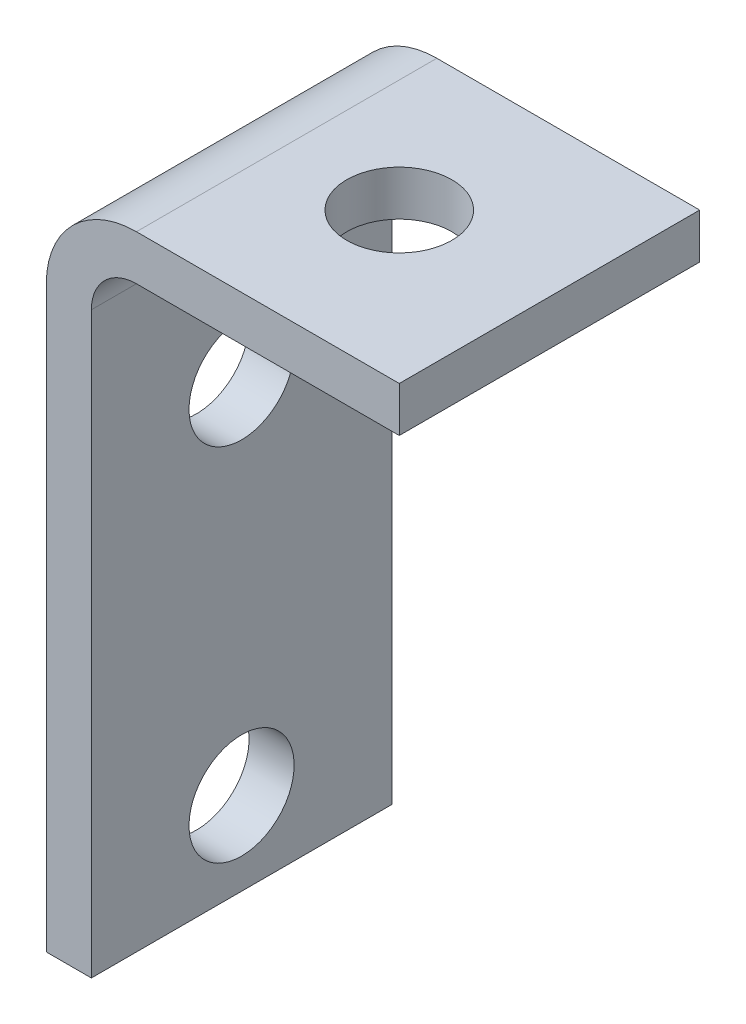
ISO-10303-21;
HEADER;
FILE_DESCRIPTION(('STEP AP214'),'2;1');
FILE_NAME('part.step','',(''),(''),'','','');
FILE_SCHEMA(('AUTOMOTIVE_DESIGN { 1 0 10303 214 1 1 1 1 }'));
ENDSEC;
DATA;
#1=APPLICATION_CONTEXT('core data for automotive mechanical design processes');
#2=APPLICATION_PROTOCOL_DEFINITION('international standard','automotive_design',2000,#1);
#3=PRODUCT_CONTEXT('',#1,'mechanical');
#4=PRODUCT('Part','Part','',(#3));
#5=PRODUCT_RELATED_PRODUCT_CATEGORY('part','',(#4));
#6=PRODUCT_DEFINITION_FORMATION('','',#4);
#7=PRODUCT_DEFINITION_CONTEXT('part definition',#1,'design');
#8=PRODUCT_DEFINITION('design','',#6,#7);
#9=PRODUCT_DEFINITION_SHAPE('','',#8);
#10=(LENGTH_UNIT() NAMED_UNIT(*) SI_UNIT(.MILLI.,.METRE.));
#11=(NAMED_UNIT(*) PLANE_ANGLE_UNIT() SI_UNIT($,.RADIAN.));
#12=(NAMED_UNIT(*) SI_UNIT($,.STERADIAN.) SOLID_ANGLE_UNIT());
#13=UNCERTAINTY_MEASURE_WITH_UNIT(LENGTH_MEASURE(1.E-05),#10,'distance_accuracy_value','');
#14=(GEOMETRIC_REPRESENTATION_CONTEXT(3) GLOBAL_UNCERTAINTY_ASSIGNED_CONTEXT((#13)) GLOBAL_UNIT_ASSIGNED_CONTEXT((#10,
#11,#12)) REPRESENTATION_CONTEXT('',''));
#15=CARTESIAN_POINT('',(0.,0.,0.));
#16=DIRECTION('',(0.,0.,1.));
#17=DIRECTION('',(1.,0.,0.));
#18=AXIS2_PLACEMENT_3D('',#15,#16,#17);
#19=CARTESIAN_POINT('',(0.,77.0555112459999,-39.9999999999999));
#20=DIRECTION('',(-1.,0.,0.));
#21=DIRECTION('',(0.,-1.,0.));
#22=AXIS2_PLACEMENT_3D('',#19,#20,#21);
#23=PLANE('',#22);
#24=CARTESIAN_POINT('',(0.,59.0555112460009,-20.));
#25=DIRECTION('',(-1.,0.,0.));
#26=DIRECTION('',(0.,0.,1.));
#27=AXIS2_PLACEMENT_3D('',#24,#25,#26);
#28=CIRCLE('',#27,6.99999999999998);
#29=CARTESIAN_POINT('',(0.,59.0555112460009,-13.));
#30=VERTEX_POINT('',#29);
#31=EDGE_CURVE('E209',#30,#30,#28,.T.);
#32=ORIENTED_EDGE('',*,*,#31,.F.);
#33=EDGE_LOOP('',(#32));
#34=FACE_BOUND('',#33,.T.);
#35=CARTESIAN_POINT('',(0.,11.055511246001,-20.));
#36=DIRECTION('',(-1.,0.,0.));
#37=DIRECTION('',(0.,0.,1.));
#38=AXIS2_PLACEMENT_3D('',#35,#36,#37);
#39=CIRCLE('',#38,6.99999999999998);
#40=CARTESIAN_POINT('',(0.,11.055511246001,-13.));
#41=VERTEX_POINT('',#40);
#42=EDGE_CURVE('E212',#41,#41,#39,.T.);
#43=ORIENTED_EDGE('',*,*,#42,.F.);
#44=EDGE_LOOP('',(#43));
#45=FACE_BOUND('',#44,.T.);
#46=DIRECTION('',(0.,-1.,0.));
#47=VECTOR('',#46,1.);
#48=CARTESIAN_POINT('',(0.,77.0555112459999,0.));
#49=LINE('',#48,#47);
#50=CARTESIAN_POINT('',(0.,77.0555112459999,0.));
#51=VERTEX_POINT('',#50);
#52=CARTESIAN_POINT('',(0.,0.,0.));
#53=VERTEX_POINT('',#52);
#54=EDGE_CURVE('E141',#51,#53,#49,.T.);
#55=ORIENTED_EDGE('',*,*,#54,.F.);
#56=DIRECTION('',(0.,0.,1.));
#57=VECTOR('',#56,1.);
#58=CARTESIAN_POINT('',(0.,77.0555112459999,-39.9999999999999));
#59=LINE('',#58,#57);
#60=CARTESIAN_POINT('',(0.,77.0555112459999,-39.9999999999999));
#61=VERTEX_POINT('',#60);
#62=EDGE_CURVE('E11',#61,#51,#59,.T.);
#63=ORIENTED_EDGE('',*,*,#62,.F.);
#64=DIRECTION('',(0.,-1.,0.));
#65=VECTOR('',#64,1.);
#66=CARTESIAN_POINT('',(0.,77.0555112459999,-39.9999999999999));
#67=LINE('',#66,#65);
#68=CARTESIAN_POINT('',(0.,0.,-39.9999999999999));
#69=VERTEX_POINT('',#68);
#70=EDGE_CURVE('E145',#61,#69,#67,.T.);
#71=ORIENTED_EDGE('',*,*,#70,.T.);
#72=DIRECTION('',(0.,0.,1.));
#73=VECTOR('',#72,1.);
#74=CARTESIAN_POINT('',(0.,0.,-39.9999999999999));
#75=LINE('',#74,#73);
#76=EDGE_CURVE('E40',#69,#53,#75,.T.);
#77=ORIENTED_EDGE('',*,*,#76,.T.);
#78=EDGE_LOOP('',(#55,#63,#71,#77));
#79=FACE_BOUND('',#78,.T.);
#80=ADVANCED_FACE('F37',(#34,#45,#79),#23,.T.);
#81=CARTESIAN_POINT('',(12.0000000000001,77.0555112459999,-39.9999999999999));
#82=DIRECTION('',(0.,0.,1.));
#83=DIRECTION('',(1.,0.,0.));
#84=AXIS2_PLACEMENT_3D('',#81,#82,#83);
#85=CYLINDRICAL_SURFACE('',#84,12.0000000000001);
#86=CARTESIAN_POINT('',(12.0000000000001,77.0555112459999,0.));
#87=DIRECTION('',(0.,0.,1.));
#88=DIRECTION('',(1.,0.,0.));
#89=AXIS2_PLACEMENT_3D('',#86,#87,#88);
#90=CIRCLE('',#89,12.0000000000001);
#91=CARTESIAN_POINT('',(12.0000000000001,89.055511246,0.));
#92=VERTEX_POINT('',#91);
#93=EDGE_CURVE('E148',#92,#51,#90,.T.);
#94=ORIENTED_EDGE('',*,*,#93,.F.);
#95=DIRECTION('',(0.,0.,1.));
#96=VECTOR('',#95,1.);
#97=CARTESIAN_POINT('',(12.0000000000001,89.055511246,-39.9999999999999));
#98=LINE('',#97,#96);
#99=CARTESIAN_POINT('',(12.0000000000001,89.055511246,-39.9999999999999));
#100=VERTEX_POINT('',#99);
#101=EDGE_CURVE('E45',#100,#92,#98,.T.);
#102=ORIENTED_EDGE('',*,*,#101,.F.);
#103=CARTESIAN_POINT('',(12.0000000000001,77.0555112459999,-39.9999999999999));
#104=DIRECTION('',(0.,0.,1.));
#105=DIRECTION('',(1.,0.,0.));
#106=AXIS2_PLACEMENT_3D('',#103,#104,#105);
#107=CIRCLE('',#106,12.0000000000001);
#108=EDGE_CURVE('E155',#100,#61,#107,.T.);
#109=ORIENTED_EDGE('',*,*,#108,.T.);
#110=ORIENTED_EDGE('',*,*,#62,.T.);
#111=EDGE_LOOP('',(#94,#102,#109,#110));
#112=FACE_BOUND('',#111,.T.);
#113=ADVANCED_FACE('F175',(#112),#85,.T.);
#114=CARTESIAN_POINT('',(47.,89.055511246,-39.9999999999999));
#115=DIRECTION('',(0.,1.,0.));
#116=DIRECTION('',(0.,0.,1.));
#117=AXIS2_PLACEMENT_3D('',#114,#115,#116);
#118=PLANE('',#117);
#119=CARTESIAN_POINT('',(27.0000000000004,89.055511246,-20.));
#120=DIRECTION('',(0.,-1.,0.));
#121=DIRECTION('',(0.,0.,-1.));
#122=AXIS2_PLACEMENT_3D('',#119,#120,#121);
#123=CIRCLE('',#122,6.99999999999998);
#124=CARTESIAN_POINT('',(27.0000000000004,89.055511246,-26.9999999999999));
#125=VERTEX_POINT('',#124);
#126=EDGE_CURVE('E219',#125,#125,#123,.T.);
#127=ORIENTED_EDGE('',*,*,#126,.T.);
#128=EDGE_LOOP('',(#127));
#129=FACE_BOUND('',#128,.T.);
#130=DIRECTION('',(-1.,0.,0.));
#131=VECTOR('',#130,1.);
#132=CARTESIAN_POINT('',(47.,89.055511246,0.));
#133=LINE('',#132,#131);
#134=CARTESIAN_POINT('',(47.,89.055511246,0.));
#135=VERTEX_POINT('',#134);
#136=EDGE_CURVE('E163',#135,#92,#133,.T.);
#137=ORIENTED_EDGE('',*,*,#136,.F.);
#138=DIRECTION('',(0.,0.,1.));
#139=VECTOR('',#138,1.);
#140=CARTESIAN_POINT('',(47.,89.055511246,-39.9999999999999));
#141=LINE('',#140,#139);
#142=CARTESIAN_POINT('',(47.,89.055511246,-39.9999999999999));
#143=VERTEX_POINT('',#142);
#144=EDGE_CURVE('E168',#143,#135,#141,.T.);
#145=ORIENTED_EDGE('',*,*,#144,.F.);
#146=DIRECTION('',(-1.,0.,0.));
#147=VECTOR('',#146,1.);
#148=CARTESIAN_POINT('',(47.,89.055511246,-39.9999999999999));
#149=LINE('',#148,#147);
#150=EDGE_CURVE('E152',#143,#100,#149,.T.);
#151=ORIENTED_EDGE('',*,*,#150,.T.);
#152=ORIENTED_EDGE('',*,*,#101,.T.);
#153=EDGE_LOOP('',(#137,#145,#151,#152));
#154=FACE_BOUND('',#153,.T.);
#155=ADVANCED_FACE('F179',(#129,#154),#118,.T.);
#156=CARTESIAN_POINT('',(47.,0.,-39.9999999999999));
#157=DIRECTION('',(1.,0.,0.));
#158=DIRECTION('',(0.,0.,-1.));
#159=AXIS2_PLACEMENT_3D('',#156,#157,#158);
#160=PLANE('',#159);
#161=DIRECTION('',(0.,0.,-1.));
#162=VECTOR('',#161,1.);
#163=CARTESIAN_POINT('',(47.,83.0555112459999,0.));
#164=LINE('',#163,#162);
#165=CARTESIAN_POINT('',(47.,83.0555112459999,0.));
#166=VERTEX_POINT('',#165);
#167=CARTESIAN_POINT('',(47.,83.0555112459999,-39.9999999999999));
#168=VERTEX_POINT('',#167);
#169=EDGE_CURVE('E53',#166,#168,#164,.T.);
#170=ORIENTED_EDGE('',*,*,#169,.T.);
#171=DIRECTION('',(0.,1.,0.));
#172=VECTOR('',#171,1.);
#173=CARTESIAN_POINT('',(47.,0.,-39.9999999999999));
#174=LINE('',#173,#172);
#175=EDGE_CURVE('E150',#168,#143,#174,.T.);
#176=ORIENTED_EDGE('',*,*,#175,.T.);
#177=ORIENTED_EDGE('',*,*,#144,.T.);
#178=DIRECTION('',(0.,1.,0.));
#179=VECTOR('',#178,1.);
#180=CARTESIAN_POINT('',(47.,0.,0.));
#181=LINE('',#180,#179);
#182=EDGE_CURVE('E161',#166,#135,#181,.T.);
#183=ORIENTED_EDGE('',*,*,#182,.F.);
#184=EDGE_LOOP('',(#170,#176,#177,#183));
#185=FACE_BOUND('',#184,.T.);
#186=ADVANCED_FACE('F257',(#185),#160,.T.);
#187=CARTESIAN_POINT('',(0.,0.,-39.9999999999999));
#188=DIRECTION('',(0.,-1.,0.));
#189=DIRECTION('',(0.,0.,-1.));
#190=AXIS2_PLACEMENT_3D('',#187,#188,#189);
#191=PLANE('',#190);
#192=DIRECTION('',(0.,0.,-1.));
#193=VECTOR('',#192,1.);
#194=CARTESIAN_POINT('',(5.99999999999998,0.,0.));
#195=LINE('',#194,#193);
#196=CARTESIAN_POINT('',(5.99999999999998,0.,0.));
#197=VERTEX_POINT('',#196);
#198=CARTESIAN_POINT('',(5.99999999999998,0.,-39.9999999999999));
#199=VERTEX_POINT('',#198);
#200=EDGE_CURVE('E142',#197,#199,#195,.T.);
#201=ORIENTED_EDGE('',*,*,#200,.F.);
#202=DIRECTION('',(1.,0.,0.));
#203=VECTOR('',#202,1.);
#204=CARTESIAN_POINT('',(0.,0.,0.));
#205=LINE('',#204,#203);
#206=EDGE_CURVE('E159',#53,#197,#205,.T.);
#207=ORIENTED_EDGE('',*,*,#206,.F.);
#208=ORIENTED_EDGE('',*,*,#76,.F.);
#209=DIRECTION('',(1.,0.,0.));
#210=VECTOR('',#209,1.);
#211=CARTESIAN_POINT('',(0.,0.,-39.9999999999999));
#212=LINE('',#211,#210);
#213=EDGE_CURVE('E147',#69,#199,#212,.T.);
#214=ORIENTED_EDGE('',*,*,#213,.T.);
#215=EDGE_LOOP('',(#201,#207,#208,#214));
#216=FACE_BOUND('',#215,.T.);
#217=ADVANCED_FACE('F174',(#216),#191,.T.);
#218=CARTESIAN_POINT('',(12.0000000000001,77.0555112459999,-39.9999999999999));
#219=DIRECTION('',(0.,0.,1.));
#220=DIRECTION('',(1.,0.,0.));
#221=AXIS2_PLACEMENT_3D('',#218,#219,#220);
#222=PLANE('',#221);
#223=CARTESIAN_POINT('',(11.9999999999999,77.055511246,-39.9999999999999));
#224=DIRECTION('',(0.,0.,-1.));
#225=DIRECTION('',(-1.,0.,0.));
#226=AXIS2_PLACEMENT_3D('',#223,#224,#225);
#227=CIRCLE('',#226,5.99999999999989);
#228=CARTESIAN_POINT('',(5.99999999999998,77.055511246,-39.9999999999999));
#229=VERTEX_POINT('',#228);
#230=CARTESIAN_POINT('',(11.9999999999999,83.0555112459999,-39.9999999999999));
#231=VERTEX_POINT('',#230);
#232=EDGE_CURVE('E116',#229,#231,#227,.T.);
#233=ORIENTED_EDGE('',*,*,#232,.F.);
#234=DIRECTION('',(0.,1.,0.));
#235=VECTOR('',#234,1.);
#236=CARTESIAN_POINT('',(5.99999999999998,0.,-39.9999999999999));
#237=LINE('',#236,#235);
#238=EDGE_CURVE('E127',#199,#229,#237,.T.);
#239=ORIENTED_EDGE('',*,*,#238,.F.);
#240=ORIENTED_EDGE('',*,*,#213,.F.);
#241=ORIENTED_EDGE('',*,*,#70,.F.);
#242=ORIENTED_EDGE('',*,*,#108,.F.);
#243=ORIENTED_EDGE('',*,*,#150,.F.);
#244=ORIENTED_EDGE('',*,*,#175,.F.);
#245=DIRECTION('',(1.,0.,0.));
#246=VECTOR('',#245,1.);
#247=CARTESIAN_POINT('',(11.9999999999999,83.0555112459999,-39.9999999999999));
#248=LINE('',#247,#246);
#249=EDGE_CURVE('E130',#231,#168,#248,.T.);
#250=ORIENTED_EDGE('',*,*,#249,.F.);
#251=EDGE_LOOP('',(#233,#239,#240,#241,#242,#243,#244,#250));
#252=FACE_BOUND('',#251,.T.);
#253=ADVANCED_FACE('F182',(#252),#222,.F.);
#254=CARTESIAN_POINT('',(12.0000000000001,77.0555112459999,0.));
#255=DIRECTION('',(0.,0.,1.));
#256=DIRECTION('',(1.,0.,0.));
#257=AXIS2_PLACEMENT_3D('',#254,#255,#256);
#258=PLANE('',#257);
#259=DIRECTION('',(0.,1.,0.));
#260=VECTOR('',#259,1.);
#261=CARTESIAN_POINT('',(5.99999999999998,0.,0.));
#262=LINE('',#261,#260);
#263=CARTESIAN_POINT('',(5.99999999999998,77.055511246,0.));
#264=VERTEX_POINT('',#263);
#265=EDGE_CURVE('E118',#197,#264,#262,.T.);
#266=ORIENTED_EDGE('',*,*,#265,.T.);
#267=CARTESIAN_POINT('',(11.9999999999999,77.055511246,0.));
#268=DIRECTION('',(0.,0.,-1.));
#269=DIRECTION('',(-1.,0.,0.));
#270=AXIS2_PLACEMENT_3D('',#267,#268,#269);
#271=CIRCLE('',#270,5.99999999999989);
#272=CARTESIAN_POINT('',(11.9999999999999,83.0555112459999,0.));
#273=VERTEX_POINT('',#272);
#274=EDGE_CURVE('E113',#264,#273,#271,.T.);
#275=ORIENTED_EDGE('',*,*,#274,.T.);
#276=DIRECTION('',(1.,0.,0.));
#277=VECTOR('',#276,1.);
#278=CARTESIAN_POINT('',(11.9999999999999,83.0555112459999,0.));
#279=LINE('',#278,#277);
#280=EDGE_CURVE('E120',#273,#166,#279,.T.);
#281=ORIENTED_EDGE('',*,*,#280,.T.);
#282=ORIENTED_EDGE('',*,*,#182,.T.);
#283=ORIENTED_EDGE('',*,*,#136,.T.);
#284=ORIENTED_EDGE('',*,*,#93,.T.);
#285=ORIENTED_EDGE('',*,*,#54,.T.);
#286=ORIENTED_EDGE('',*,*,#206,.T.);
#287=EDGE_LOOP('',(#266,#275,#281,#282,#283,#284,#285,#286));
#288=FACE_BOUND('',#287,.T.);
#289=ADVANCED_FACE('F125',(#288),#258,.T.);
#290=CARTESIAN_POINT('',(11.9999999999999,77.055511246,0.));
#291=DIRECTION('',(0.,0.,-1.));
#292=DIRECTION('',(-1.,0.,0.));
#293=AXIS2_PLACEMENT_3D('',#290,#291,#292);
#294=CYLINDRICAL_SURFACE('',#293,5.99999999999989);
#295=ORIENTED_EDGE('',*,*,#232,.T.);
#296=DIRECTION('',(0.,0.,-1.));
#297=VECTOR('',#296,1.);
#298=CARTESIAN_POINT('',(11.9999999999999,83.0555112459999,0.));
#299=LINE('',#298,#297);
#300=EDGE_CURVE('E110',#273,#231,#299,.T.);
#301=ORIENTED_EDGE('',*,*,#300,.F.);
#302=ORIENTED_EDGE('',*,*,#274,.F.);
#303=DIRECTION('',(0.,0.,-1.));
#304=VECTOR('',#303,1.);
#305=CARTESIAN_POINT('',(5.99999999999998,77.055511246,0.));
#306=LINE('',#305,#304);
#307=EDGE_CURVE('E139',#264,#229,#306,.T.);
#308=ORIENTED_EDGE('',*,*,#307,.T.);
#309=EDGE_LOOP('',(#295,#301,#302,#308));
#310=FACE_BOUND('',#309,.T.);
#311=ADVANCED_FACE('F111',(#310),#294,.F.);
#312=CARTESIAN_POINT('',(5.99999999999998,0.,0.));
#313=DIRECTION('',(-1.,0.,0.));
#314=DIRECTION('',(0.,-1.,0.));
#315=AXIS2_PLACEMENT_3D('',#312,#313,#314);
#316=PLANE('',#315);
#317=CARTESIAN_POINT('',(5.99999999999998,59.0555112460009,-20.));
#318=DIRECTION('',(-1.,0.,0.));
#319=DIRECTION('',(0.,-1.,0.));
#320=AXIS2_PLACEMENT_3D('',#317,#318,#319);
#321=CIRCLE('',#320,6.99999999999998);
#322=CARTESIAN_POINT('',(5.99999999999998,52.055511246001,-20.));
#323=VERTEX_POINT('',#322);
#324=EDGE_CURVE('E214',#323,#323,#321,.T.);
#325=ORIENTED_EDGE('',*,*,#324,.T.);
#326=EDGE_LOOP('',(#325));
#327=FACE_BOUND('',#326,.T.);
#328=CARTESIAN_POINT('',(5.99999999999998,11.055511246001,-20.));
#329=DIRECTION('',(-1.,0.,0.));
#330=DIRECTION('',(0.,-1.,0.));
#331=AXIS2_PLACEMENT_3D('',#328,#329,#330);
#332=CIRCLE('',#331,6.99999999999998);
#333=CARTESIAN_POINT('',(5.99999999999998,4.05551124600103,-20.));
#334=VERTEX_POINT('',#333);
#335=EDGE_CURVE('E133',#334,#334,#332,.T.);
#336=ORIENTED_EDGE('',*,*,#335,.T.);
#337=EDGE_LOOP('',(#336));
#338=FACE_BOUND('',#337,.T.);
#339=ORIENTED_EDGE('',*,*,#238,.T.);
#340=ORIENTED_EDGE('',*,*,#307,.F.);
#341=ORIENTED_EDGE('',*,*,#265,.F.);
#342=ORIENTED_EDGE('',*,*,#200,.T.);
#343=EDGE_LOOP('',(#339,#340,#341,#342));
#344=FACE_BOUND('',#343,.T.);
#345=ADVANCED_FACE('F185',(#327,#338,#344),#316,.F.);
#346=CARTESIAN_POINT('',(11.9999999999999,83.0555112459999,0.));
#347=DIRECTION('',(0.,1.,0.));
#348=DIRECTION('',(0.,0.,1.));
#349=AXIS2_PLACEMENT_3D('',#346,#347,#348);
#350=PLANE('',#349);
#351=CARTESIAN_POINT('',(27.0000000000004,83.0555112459999,-20.));
#352=DIRECTION('',(0.,-1.,0.));
#353=DIRECTION('',(0.,0.,-1.));
#354=AXIS2_PLACEMENT_3D('',#351,#352,#353);
#355=CIRCLE('',#354,6.99999999999998);
#356=CARTESIAN_POINT('',(27.0000000000004,83.0555112459999,-26.9999999999999));
#357=VERTEX_POINT('',#356);
#358=EDGE_CURVE('E222',#357,#357,#355,.T.);
#359=ORIENTED_EDGE('',*,*,#358,.F.);
#360=EDGE_LOOP('',(#359));
#361=FACE_BOUND('',#360,.T.);
#362=ORIENTED_EDGE('',*,*,#249,.T.);
#363=ORIENTED_EDGE('',*,*,#169,.F.);
#364=ORIENTED_EDGE('',*,*,#280,.F.);
#365=ORIENTED_EDGE('',*,*,#300,.T.);
#366=EDGE_LOOP('',(#362,#363,#364,#365));
#367=FACE_BOUND('',#366,.T.);
#368=ADVANCED_FACE('F121',(#361,#367),#350,.F.);
#369=CARTESIAN_POINT('',(0.,11.055511246001,-20.));
#370=DIRECTION('',(-1.,0.,0.));
#371=DIRECTION('',(0.,0.,1.));
#372=AXIS2_PLACEMENT_3D('',#369,#370,#371);
#373=CYLINDRICAL_SURFACE('',#372,6.99999999999998);
#374=ORIENTED_EDGE('',*,*,#42,.T.);
#375=EDGE_LOOP('',(#374));
#376=FACE_BOUND('',#375,.T.);
#377=ORIENTED_EDGE('',*,*,#335,.F.);
#378=EDGE_LOOP('',(#377));
#379=FACE_BOUND('',#378,.T.);
#380=ADVANCED_FACE('F193',(#376,#379),#373,.F.);
#381=CARTESIAN_POINT('',(0.,59.0555112460009,-20.));
#382=DIRECTION('',(-1.,0.,0.));
#383=DIRECTION('',(0.,0.,1.));
#384=AXIS2_PLACEMENT_3D('',#381,#382,#383);
#385=CYLINDRICAL_SURFACE('',#384,6.99999999999998);
#386=ORIENTED_EDGE('',*,*,#31,.T.);
#387=EDGE_LOOP('',(#386));
#388=FACE_BOUND('',#387,.T.);
#389=ORIENTED_EDGE('',*,*,#324,.F.);
#390=EDGE_LOOP('',(#389));
#391=FACE_BOUND('',#390,.T.);
#392=ADVANCED_FACE('F228',(#388,#391),#385,.F.);
#393=CARTESIAN_POINT('',(27.0000000000004,83.0555112459999,-20.));
#394=DIRECTION('',(0.,-1.,0.));
#395=DIRECTION('',(0.,0.,-1.));
#396=AXIS2_PLACEMENT_3D('',#393,#394,#395);
#397=CYLINDRICAL_SURFACE('',#396,6.99999999999998);
#398=ORIENTED_EDGE('',*,*,#126,.F.);
#399=EDGE_LOOP('',(#398));
#400=FACE_BOUND('',#399,.T.);
#401=ORIENTED_EDGE('',*,*,#358,.T.);
#402=EDGE_LOOP('',(#401));
#403=FACE_BOUND('',#402,.T.);
#404=ADVANCED_FACE('F226',(#400,#403),#397,.F.);
#405=CLOSED_SHELL('',(#80,#113,#155,#186,#217,#253,#289,#311,#345,#368,#380,#392,#404));
#406=MANIFOLD_SOLID_BREP('B2',#405);
#407=ADVANCED_BREP_SHAPE_REPRESENTATION('',(#18,#406),#14);
#408=SHAPE_DEFINITION_REPRESENTATION(#9,#407);
ENDSEC;
END-ISO-10303-21;
